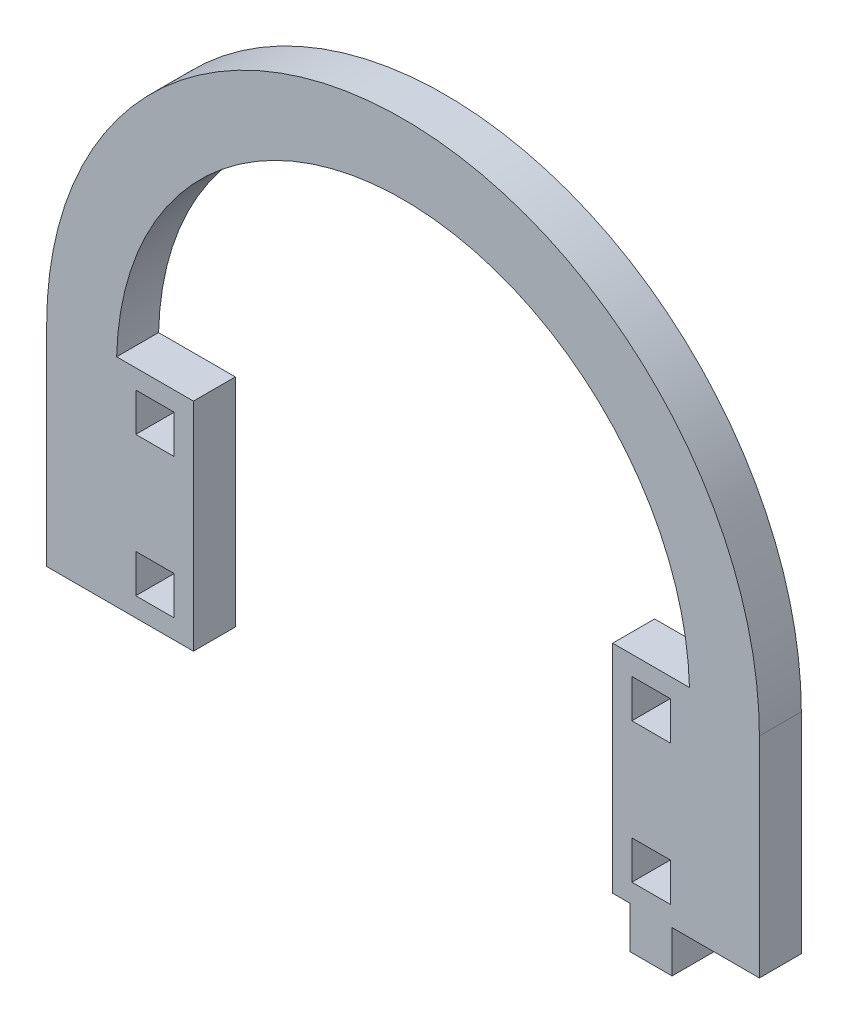
ISO-10303-21;
HEADER;
FILE_DESCRIPTION(('STEP AP214'),'2;1');
FILE_NAME('part.step','',(''),(''),'','','');
FILE_SCHEMA(('AUTOMOTIVE_DESIGN { 1 0 10303 214 1 1 1 1 }'));
ENDSEC;
DATA;
#1=APPLICATION_CONTEXT('core data for automotive mechanical design processes');
#2=APPLICATION_PROTOCOL_DEFINITION('international standard','automotive_design',2000,#1);
#3=PRODUCT_CONTEXT('',#1,'mechanical');
#4=PRODUCT('Part','Part','',(#3));
#5=PRODUCT_RELATED_PRODUCT_CATEGORY('part','',(#4));
#6=PRODUCT_DEFINITION_FORMATION('','',#4);
#7=PRODUCT_DEFINITION_CONTEXT('part definition',#1,'design');
#8=PRODUCT_DEFINITION('design','',#6,#7);
#9=PRODUCT_DEFINITION_SHAPE('','',#8);
#10=(LENGTH_UNIT() NAMED_UNIT(*) SI_UNIT(.MILLI.,.METRE.));
#11=(NAMED_UNIT(*) PLANE_ANGLE_UNIT() SI_UNIT($,.RADIAN.));
#12=(NAMED_UNIT(*) SI_UNIT($,.STERADIAN.) SOLID_ANGLE_UNIT());
#13=UNCERTAINTY_MEASURE_WITH_UNIT(LENGTH_MEASURE(1.E-05),#10,'distance_accuracy_value','');
#14=(GEOMETRIC_REPRESENTATION_CONTEXT(3) GLOBAL_UNCERTAINTY_ASSIGNED_CONTEXT((#13)) GLOBAL_UNIT_ASSIGNED_CONTEXT((#10,
#11,#12)) REPRESENTATION_CONTEXT('',''));
#15=CARTESIAN_POINT('',(0.,0.,0.));
#16=DIRECTION('',(0.,0.,1.));
#17=DIRECTION('',(1.,0.,0.));
#18=AXIS2_PLACEMENT_3D('',#15,#16,#17);
#19=CARTESIAN_POINT('',(3308.613450603,1322.3552410198,6.));
#20=DIRECTION('',(0.,0.,1.));
#21=DIRECTION('',(1.,0.,0.));
#22=AXIS2_PLACEMENT_3D('',#19,#20,#21);
#23=PLANE('',#22);
#24=CARTESIAN_POINT('',(3308.613450603,1322.3552410198,6.));
#25=DIRECTION('',(0.,0.,1.));
#26=DIRECTION('',(1.,0.,0.));
#27=AXIS2_PLACEMENT_3D('',#24,#25,#26);
#28=CIRCLE('',#27,50.9999999999999);
#29=CARTESIAN_POINT('',(3359.613450603,1322.3552410198,6.));
#30=VERTEX_POINT('',#29);
#31=CARTESIAN_POINT('',(3257.613450603,1322.3552410198,6.));
#32=VERTEX_POINT('',#31);
#33=EDGE_CURVE('E642',#30,#32,#28,.T.);
#34=ORIENTED_EDGE('',*,*,#33,.T.);
#35=DIRECTION('',(0.,-1.,0.));
#36=VECTOR('',#35,1.);
#37=CARTESIAN_POINT('',(3257.613450603,1322.3552410198,6.));
#38=LINE('',#37,#36);
#39=CARTESIAN_POINT('',(3257.613450603,1292.3552410198,6.));
#40=VERTEX_POINT('',#39);
#41=EDGE_CURVE('E646',#32,#40,#38,.T.);
#42=ORIENTED_EDGE('',*,*,#41,.T.);
#43=DIRECTION('',(1.,0.,0.));
#44=VECTOR('',#43,1.);
#45=CARTESIAN_POINT('',(3257.613450603,1292.3552410198,6.));
#46=LINE('',#45,#44);
#47=CARTESIAN_POINT('',(3278.613450603,1292.3552410198,6.));
#48=VERTEX_POINT('',#47);
#49=EDGE_CURVE('E650',#40,#48,#46,.T.);
#50=ORIENTED_EDGE('',*,*,#49,.T.);
#51=DIRECTION('',(0.,-1.,0.));
#52=VECTOR('',#51,1.);
#53=CARTESIAN_POINT('',(3278.613450603,1323.3552410198,6.));
#54=LINE('',#53,#52);
#55=CARTESIAN_POINT('',(3278.613450603,1323.3552410198,6.));
#56=VERTEX_POINT('',#55);
#57=EDGE_CURVE('E653',#56,#48,#54,.T.);
#58=ORIENTED_EDGE('',*,*,#57,.F.);
#59=DIRECTION('',(1.,0.,0.));
#60=VECTOR('',#59,1.);
#61=CARTESIAN_POINT('',(3267.62564753916,1323.3552410198,6.));
#62=LINE('',#61,#60);
#63=CARTESIAN_POINT('',(3267.62564753916,1323.3552410198,6.));
#64=VERTEX_POINT('',#63);
#65=EDGE_CURVE('E657',#64,#56,#62,.T.);
#66=ORIENTED_EDGE('',*,*,#65,.F.);
#67=CARTESIAN_POINT('',(3308.613450603,1322.3552410198,6.));
#68=DIRECTION('',(0.,0.,1.));
#69=DIRECTION('',(1.,0.,0.));
#70=AXIS2_PLACEMENT_3D('',#67,#68,#69);
#71=CIRCLE('',#70,40.9999999999998);
#72=CARTESIAN_POINT('',(3349.60125366684,1323.3552410198,6.));
#73=VERTEX_POINT('',#72);
#74=EDGE_CURVE('E661',#73,#64,#71,.T.);
#75=ORIENTED_EDGE('',*,*,#74,.F.);
#76=DIRECTION('',(1.,0.,0.));
#77=VECTOR('',#76,1.);
#78=CARTESIAN_POINT('',(3338.613450603,1323.3552410198,6.));
#79=LINE('',#78,#77);
#80=CARTESIAN_POINT('',(3338.613450603,1323.3552410198,6.));
#81=VERTEX_POINT('',#80);
#82=EDGE_CURVE('E665',#81,#73,#79,.T.);
#83=ORIENTED_EDGE('',*,*,#82,.F.);
#84=DIRECTION('',(0.,-1.,0.));
#85=VECTOR('',#84,1.);
#86=CARTESIAN_POINT('',(3338.613450603,1323.3552410198,6.));
#87=LINE('',#86,#85);
#88=CARTESIAN_POINT('',(3338.613450603,1292.3552410198,6.));
#89=VERTEX_POINT('',#88);
#90=EDGE_CURVE('E669',#81,#89,#87,.T.);
#91=ORIENTED_EDGE('',*,*,#90,.T.);
#92=DIRECTION('',(1.,0.,0.));
#93=VECTOR('',#92,1.);
#94=CARTESIAN_POINT('',(3338.613450603,1292.3552410198,6.));
#95=LINE('',#94,#93);
#96=CARTESIAN_POINT('',(3341.113450603,1292.3552410198,6.));
#97=VERTEX_POINT('',#96);
#98=EDGE_CURVE('E672',#89,#97,#95,.T.);
#99=ORIENTED_EDGE('',*,*,#98,.T.);
#100=DIRECTION('',(0.,-1.,0.));
#101=VECTOR('',#100,1.);
#102=CARTESIAN_POINT('',(3341.113450603,1292.3552410198,6.));
#103=LINE('',#102,#101);
#104=CARTESIAN_POINT('',(3341.113450603,1286.3552410198,6.));
#105=VERTEX_POINT('',#104);
#106=EDGE_CURVE('E675',#97,#105,#103,.T.);
#107=ORIENTED_EDGE('',*,*,#106,.T.);
#108=DIRECTION('',(1.,0.,0.));
#109=VECTOR('',#108,1.);
#110=CARTESIAN_POINT('',(3341.113450603,1286.3552410198,6.));
#111=LINE('',#110,#109);
#112=CARTESIAN_POINT('',(3347.113450603,1286.3552410198,6.));
#113=VERTEX_POINT('',#112);
#114=EDGE_CURVE('E678',#105,#113,#111,.T.);
#115=ORIENTED_EDGE('',*,*,#114,.T.);
#116=DIRECTION('',(0.,1.,0.));
#117=VECTOR('',#116,1.);
#118=CARTESIAN_POINT('',(3347.113450603,1286.3552410198,6.));
#119=LINE('',#118,#117);
#120=CARTESIAN_POINT('',(3347.113450603,1292.3552410198,6.));
#121=VERTEX_POINT('',#120);
#122=EDGE_CURVE('E681',#113,#121,#119,.T.);
#123=ORIENTED_EDGE('',*,*,#122,.T.);
#124=DIRECTION('',(1.,0.,0.));
#125=VECTOR('',#124,1.);
#126=CARTESIAN_POINT('',(3347.113450603,1292.3552410198,6.));
#127=LINE('',#126,#125);
#128=CARTESIAN_POINT('',(3359.613450603,1292.3552410198,6.));
#129=VERTEX_POINT('',#128);
#130=EDGE_CURVE('E684',#121,#129,#127,.T.);
#131=ORIENTED_EDGE('',*,*,#130,.T.);
#132=DIRECTION('',(0.,-1.,0.));
#133=VECTOR('',#132,1.);
#134=CARTESIAN_POINT('',(3359.613450603,1322.3552410198,6.));
#135=LINE('',#134,#133);
#136=EDGE_CURVE('E687',#30,#129,#135,.T.);
#137=ORIENTED_EDGE('',*,*,#136,.F.);
#138=EDGE_LOOP('',(#34,#42,#50,#58,#66,#75,#83,#91,#99,#107,#115,#123,#131,#137));
#139=FACE_BOUND('',#138,.T.);
#140=DIRECTION('',(0.,1.,0.));
#141=VECTOR('',#140,1.);
#142=CARTESIAN_POINT('',(3275.863450603,0.,6.));
#143=LINE('',#142,#141);
#144=CARTESIAN_POINT('',(3275.863450603,1315.1052410198,6.));
#145=VERTEX_POINT('',#144);
#146=CARTESIAN_POINT('',(3275.863450603,1320.6052410198,6.));
#147=VERTEX_POINT('',#146);
#148=EDGE_CURVE('E602',#145,#147,#143,.T.);
#149=ORIENTED_EDGE('',*,*,#148,.F.);
#150=DIRECTION('',(1.,0.,0.));
#151=VECTOR('',#150,1.);
#152=CARTESIAN_POINT('',(0.,1315.1052410198,6.));
#153=LINE('',#152,#151);
#154=CARTESIAN_POINT('',(3270.363450603,1315.1052410198,6.));
#155=VERTEX_POINT('',#154);
#156=EDGE_CURVE('E599',#155,#145,#153,.T.);
#157=ORIENTED_EDGE('',*,*,#156,.F.);
#158=DIRECTION('',(0.,-1.,0.));
#159=VECTOR('',#158,1.);
#160=CARTESIAN_POINT('',(3270.363450603,0.,6.));
#161=LINE('',#160,#159);
#162=CARTESIAN_POINT('',(3270.363450603,1320.6052410198,6.));
#163=VERTEX_POINT('',#162);
#164=EDGE_CURVE('E610',#163,#155,#161,.T.);
#165=ORIENTED_EDGE('',*,*,#164,.F.);
#166=DIRECTION('',(-1.,0.,0.));
#167=VECTOR('',#166,1.);
#168=CARTESIAN_POINT('',(0.,1320.6052410198,6.));
#169=LINE('',#168,#167);
#170=EDGE_CURVE('E606',#147,#163,#169,.T.);
#171=ORIENTED_EDGE('',*,*,#170,.F.);
#172=EDGE_LOOP('',(#149,#157,#165,#171));
#173=FACE_BOUND('',#172,.T.);
#174=DIRECTION('',(0.,1.,0.));
#175=VECTOR('',#174,1.);
#176=CARTESIAN_POINT('',(3275.863450603,0.,6.));
#177=LINE('',#176,#175);
#178=CARTESIAN_POINT('',(3275.863450603,1295.1052410198,6.));
#179=VERTEX_POINT('',#178);
#180=CARTESIAN_POINT('',(3275.863450603,1300.6052410198,6.));
#181=VERTEX_POINT('',#180);
#182=EDGE_CURVE('E559',#179,#181,#177,.T.);
#183=ORIENTED_EDGE('',*,*,#182,.F.);
#184=DIRECTION('',(1.,0.,0.));
#185=VECTOR('',#184,1.);
#186=CARTESIAN_POINT('',(0.,1295.1052410198,6.));
#187=LINE('',#186,#185);
#188=CARTESIAN_POINT('',(3270.363450603,1295.1052410198,6.));
#189=VERTEX_POINT('',#188);
#190=EDGE_CURVE('E556',#189,#179,#187,.T.);
#191=ORIENTED_EDGE('',*,*,#190,.F.);
#192=DIRECTION('',(0.,-1.,0.));
#193=VECTOR('',#192,1.);
#194=CARTESIAN_POINT('',(3270.363450603,0.,6.));
#195=LINE('',#194,#193);
#196=CARTESIAN_POINT('',(3270.363450603,1300.6052410198,6.));
#197=VERTEX_POINT('',#196);
#198=EDGE_CURVE('E567',#197,#189,#195,.T.);
#199=ORIENTED_EDGE('',*,*,#198,.F.);
#200=DIRECTION('',(-1.,0.,0.));
#201=VECTOR('',#200,1.);
#202=CARTESIAN_POINT('',(0.,1300.6052410198,6.));
#203=LINE('',#202,#201);
#204=EDGE_CURVE('E563',#181,#197,#203,.T.);
#205=ORIENTED_EDGE('',*,*,#204,.F.);
#206=EDGE_LOOP('',(#183,#191,#199,#205));
#207=FACE_BOUND('',#206,.T.);
#208=DIRECTION('',(0.,1.,0.));
#209=VECTOR('',#208,1.);
#210=CARTESIAN_POINT('',(3346.863450603,0.,6.));
#211=LINE('',#210,#209);
#212=CARTESIAN_POINT('',(3346.863450603,1315.1052410198,6.));
#213=VERTEX_POINT('',#212);
#214=CARTESIAN_POINT('',(3346.863450603,1320.6052410198,6.));
#215=VERTEX_POINT('',#214);
#216=EDGE_CURVE('E516',#213,#215,#211,.T.);
#217=ORIENTED_EDGE('',*,*,#216,.F.);
#218=DIRECTION('',(1.,0.,0.));
#219=VECTOR('',#218,1.);
#220=CARTESIAN_POINT('',(0.,1315.1052410198,6.));
#221=LINE('',#220,#219);
#222=CARTESIAN_POINT('',(3341.363450603,1315.1052410198,6.));
#223=VERTEX_POINT('',#222);
#224=EDGE_CURVE('E513',#223,#213,#221,.T.);
#225=ORIENTED_EDGE('',*,*,#224,.F.);
#226=DIRECTION('',(0.,-1.,0.));
#227=VECTOR('',#226,1.);
#228=CARTESIAN_POINT('',(3341.363450603,0.,6.));
#229=LINE('',#228,#227);
#230=CARTESIAN_POINT('',(3341.363450603,1320.6052410198,6.));
#231=VERTEX_POINT('',#230);
#232=EDGE_CURVE('E524',#231,#223,#229,.T.);
#233=ORIENTED_EDGE('',*,*,#232,.F.);
#234=DIRECTION('',(-1.,0.,0.));
#235=VECTOR('',#234,1.);
#236=CARTESIAN_POINT('',(0.,1320.6052410198,6.));
#237=LINE('',#236,#235);
#238=EDGE_CURVE('E520',#215,#231,#237,.T.);
#239=ORIENTED_EDGE('',*,*,#238,.F.);
#240=EDGE_LOOP('',(#217,#225,#233,#239));
#241=FACE_BOUND('',#240,.T.);
#242=DIRECTION('',(0.,1.,0.));
#243=VECTOR('',#242,1.);
#244=CARTESIAN_POINT('',(3346.863450603,0.,6.));
#245=LINE('',#244,#243);
#246=CARTESIAN_POINT('',(3346.863450603,1295.1052410198,6.));
#247=VERTEX_POINT('',#246);
#248=CARTESIAN_POINT('',(3346.863450603,1300.6052410198,6.));
#249=VERTEX_POINT('',#248);
#250=EDGE_CURVE('E474',#247,#249,#245,.T.);
#251=ORIENTED_EDGE('',*,*,#250,.F.);
#252=DIRECTION('',(1.,0.,0.));
#253=VECTOR('',#252,1.);
#254=CARTESIAN_POINT('',(0.,1295.1052410198,6.));
#255=LINE('',#254,#253);
#256=CARTESIAN_POINT('',(3341.363450603,1295.1052410198,6.));
#257=VERTEX_POINT('',#256);
#258=EDGE_CURVE('E465',#257,#247,#255,.T.);
#259=ORIENTED_EDGE('',*,*,#258,.F.);
#260=DIRECTION('',(0.,-1.,0.));
#261=VECTOR('',#260,1.);
#262=CARTESIAN_POINT('',(3341.363450603,0.,6.));
#263=LINE('',#262,#261);
#264=CARTESIAN_POINT('',(3341.363450603,1300.6052410198,6.));
#265=VERTEX_POINT('',#264);
#266=EDGE_CURVE('E491',#265,#257,#263,.T.);
#267=ORIENTED_EDGE('',*,*,#266,.F.);
#268=DIRECTION('',(-1.,0.,0.));
#269=VECTOR('',#268,1.);
#270=CARTESIAN_POINT('',(0.,1300.6052410198,6.));
#271=LINE('',#270,#269);
#272=EDGE_CURVE('E487',#249,#265,#271,.T.);
#273=ORIENTED_EDGE('',*,*,#272,.F.);
#274=EDGE_LOOP('',(#251,#259,#267,#273));
#275=FACE_BOUND('',#274,.T.);
#276=ADVANCED_FACE('F267',(#139,#173,#207,#241,#275),#23,.T.);
#277=CARTESIAN_POINT('',(3308.613450603,1322.3552410198,0.));
#278=DIRECTION('',(0.,0.,1.));
#279=DIRECTION('',(1.,0.,0.));
#280=AXIS2_PLACEMENT_3D('',#277,#278,#279);
#281=PLANE('',#280);
#282=DIRECTION('',(1.,0.,0.));
#283=VECTOR('',#282,1.);
#284=CARTESIAN_POINT('',(0.,1315.1052410198,0.));
#285=LINE('',#284,#283);
#286=CARTESIAN_POINT('',(3341.363450603,1315.1052410198,0.));
#287=VERTEX_POINT('',#286);
#288=CARTESIAN_POINT('',(3346.863450603,1315.1052410198,0.));
#289=VERTEX_POINT('',#288);
#290=EDGE_CURVE('E483',#287,#289,#285,.T.);
#291=ORIENTED_EDGE('',*,*,#290,.T.);
#292=DIRECTION('',(0.,1.,0.));
#293=VECTOR('',#292,1.);
#294=CARTESIAN_POINT('',(3346.863450603,0.,0.));
#295=LINE('',#294,#293);
#296=CARTESIAN_POINT('',(3346.863450603,1320.6052410198,0.));
#297=VERTEX_POINT('',#296);
#298=EDGE_CURVE('E531',#289,#297,#295,.T.);
#299=ORIENTED_EDGE('',*,*,#298,.T.);
#300=DIRECTION('',(-1.,0.,0.));
#301=VECTOR('',#300,1.);
#302=CARTESIAN_POINT('',(0.,1320.6052410198,0.));
#303=LINE('',#302,#301);
#304=CARTESIAN_POINT('',(3341.363450603,1320.6052410198,0.));
#305=VERTEX_POINT('',#304);
#306=EDGE_CURVE('E535',#297,#305,#303,.T.);
#307=ORIENTED_EDGE('',*,*,#306,.T.);
#308=DIRECTION('',(0.,-1.,0.));
#309=VECTOR('',#308,1.);
#310=CARTESIAN_POINT('',(3341.363450603,0.,0.));
#311=LINE('',#310,#309);
#312=EDGE_CURVE('E517',#305,#287,#311,.T.);
#313=ORIENTED_EDGE('',*,*,#312,.T.);
#314=EDGE_LOOP('',(#291,#299,#307,#313));
#315=FACE_BOUND('',#314,.T.);
#316=DIRECTION('',(1.,0.,0.));
#317=VECTOR('',#316,1.);
#318=CARTESIAN_POINT('',(0.,1315.1052410198,0.));
#319=LINE('',#318,#317);
#320=CARTESIAN_POINT('',(3270.363450603,1315.1052410198,0.));
#321=VERTEX_POINT('',#320);
#322=CARTESIAN_POINT('',(3275.863450603,1315.1052410198,0.));
#323=VERTEX_POINT('',#322);
#324=EDGE_CURVE('E598',#321,#323,#319,.T.);
#325=ORIENTED_EDGE('',*,*,#324,.T.);
#326=DIRECTION('',(0.,1.,0.));
#327=VECTOR('',#326,1.);
#328=CARTESIAN_POINT('',(3275.863450603,0.,0.));
#329=LINE('',#328,#327);
#330=CARTESIAN_POINT('',(3275.863450603,1320.6052410198,0.));
#331=VERTEX_POINT('',#330);
#332=EDGE_CURVE('E617',#323,#331,#329,.T.);
#333=ORIENTED_EDGE('',*,*,#332,.T.);
#334=DIRECTION('',(-1.,0.,0.));
#335=VECTOR('',#334,1.);
#336=CARTESIAN_POINT('',(0.,1320.6052410198,0.));
#337=LINE('',#336,#335);
#338=CARTESIAN_POINT('',(3270.363450603,1320.6052410198,0.));
#339=VERTEX_POINT('',#338);
#340=EDGE_CURVE('E621',#331,#339,#337,.T.);
#341=ORIENTED_EDGE('',*,*,#340,.T.);
#342=DIRECTION('',(0.,-1.,0.));
#343=VECTOR('',#342,1.);
#344=CARTESIAN_POINT('',(3270.363450603,0.,0.));
#345=LINE('',#344,#343);
#346=EDGE_CURVE('E603',#339,#321,#345,.T.);
#347=ORIENTED_EDGE('',*,*,#346,.T.);
#348=EDGE_LOOP('',(#325,#333,#341,#347));
#349=FACE_BOUND('',#348,.T.);
#350=CARTESIAN_POINT('',(3308.613450603,1322.3552410198,0.));
#351=DIRECTION('',(0.,0.,1.));
#352=DIRECTION('',(1.,0.,0.));
#353=AXIS2_PLACEMENT_3D('',#350,#351,#352);
#354=CIRCLE('',#353,50.9999999999999);
#355=CARTESIAN_POINT('',(3359.613450603,1322.3552410198,0.));
#356=VERTEX_POINT('',#355);
#357=CARTESIAN_POINT('',(3257.613450603,1322.3552410198,0.));
#358=VERTEX_POINT('',#357);
#359=EDGE_CURVE('E641',#356,#358,#354,.T.);
#360=ORIENTED_EDGE('',*,*,#359,.F.);
#361=DIRECTION('',(0.,-1.,0.));
#362=VECTOR('',#361,1.);
#363=CARTESIAN_POINT('',(3359.613450603,1322.3552410198,0.));
#364=LINE('',#363,#362);
#365=CARTESIAN_POINT('',(3359.613450603,1292.3552410198,0.));
#366=VERTEX_POINT('',#365);
#367=EDGE_CURVE('E647',#356,#366,#364,.T.);
#368=ORIENTED_EDGE('',*,*,#367,.T.);
#369=DIRECTION('',(1.,0.,0.));
#370=VECTOR('',#369,1.);
#371=CARTESIAN_POINT('',(3347.113450603,1292.3552410198,0.));
#372=LINE('',#371,#370);
#373=CARTESIAN_POINT('',(3347.113450603,1292.3552410198,0.));
#374=VERTEX_POINT('',#373);
#375=EDGE_CURVE('E734',#374,#366,#372,.T.);
#376=ORIENTED_EDGE('',*,*,#375,.F.);
#377=DIRECTION('',(0.,1.,0.));
#378=VECTOR('',#377,1.);
#379=CARTESIAN_POINT('',(3347.113450603,1286.3552410198,0.));
#380=LINE('',#379,#378);
#381=CARTESIAN_POINT('',(3347.113450603,1286.3552410198,0.));
#382=VERTEX_POINT('',#381);
#383=EDGE_CURVE('E731',#382,#374,#380,.T.);
#384=ORIENTED_EDGE('',*,*,#383,.F.);
#385=DIRECTION('',(1.,0.,0.));
#386=VECTOR('',#385,1.);
#387=CARTESIAN_POINT('',(3341.113450603,1286.3552410198,0.));
#388=LINE('',#387,#386);
#389=CARTESIAN_POINT('',(3341.113450603,1286.3552410198,0.));
#390=VERTEX_POINT('',#389);
#391=EDGE_CURVE('E728',#390,#382,#388,.T.);
#392=ORIENTED_EDGE('',*,*,#391,.F.);
#393=DIRECTION('',(0.,-1.,0.));
#394=VECTOR('',#393,1.);
#395=CARTESIAN_POINT('',(3341.113450603,1292.3552410198,0.));
#396=LINE('',#395,#394);
#397=CARTESIAN_POINT('',(3341.113450603,1292.3552410198,0.));
#398=VERTEX_POINT('',#397);
#399=EDGE_CURVE('E725',#398,#390,#396,.T.);
#400=ORIENTED_EDGE('',*,*,#399,.F.);
#401=DIRECTION('',(1.,0.,0.));
#402=VECTOR('',#401,1.);
#403=CARTESIAN_POINT('',(3338.613450603,1292.3552410198,0.));
#404=LINE('',#403,#402);
#405=CARTESIAN_POINT('',(3338.613450603,1292.3552410198,0.));
#406=VERTEX_POINT('',#405);
#407=EDGE_CURVE('E722',#406,#398,#404,.T.);
#408=ORIENTED_EDGE('',*,*,#407,.F.);
#409=DIRECTION('',(0.,-1.,0.));
#410=VECTOR('',#409,1.);
#411=CARTESIAN_POINT('',(3338.613450603,1323.3552410198,0.));
#412=LINE('',#411,#410);
#413=CARTESIAN_POINT('',(3338.613450603,1323.3552410198,0.));
#414=VERTEX_POINT('',#413);
#415=EDGE_CURVE('E719',#414,#406,#412,.T.);
#416=ORIENTED_EDGE('',*,*,#415,.F.);
#417=DIRECTION('',(1.,0.,0.));
#418=VECTOR('',#417,1.);
#419=CARTESIAN_POINT('',(3338.613450603,1323.3552410198,0.));
#420=LINE('',#419,#418);
#421=CARTESIAN_POINT('',(3349.60125366684,1323.3552410198,0.));
#422=VERTEX_POINT('',#421);
#423=EDGE_CURVE('E715',#414,#422,#420,.T.);
#424=ORIENTED_EDGE('',*,*,#423,.T.);
#425=CARTESIAN_POINT('',(3308.613450603,1322.3552410198,0.));
#426=DIRECTION('',(0.,0.,1.));
#427=DIRECTION('',(1.,0.,0.));
#428=AXIS2_PLACEMENT_3D('',#425,#426,#427);
#429=CIRCLE('',#428,40.9999999999998);
#430=CARTESIAN_POINT('',(3267.62564753916,1323.3552410198,0.));
#431=VERTEX_POINT('',#430);
#432=EDGE_CURVE('E711',#422,#431,#429,.T.);
#433=ORIENTED_EDGE('',*,*,#432,.T.);
#434=DIRECTION('',(1.,0.,0.));
#435=VECTOR('',#434,1.);
#436=CARTESIAN_POINT('',(3267.62564753916,1323.3552410198,0.));
#437=LINE('',#436,#435);
#438=CARTESIAN_POINT('',(3278.613450603,1323.3552410198,0.));
#439=VERTEX_POINT('',#438);
#440=EDGE_CURVE('E707',#431,#439,#437,.T.);
#441=ORIENTED_EDGE('',*,*,#440,.T.);
#442=DIRECTION('',(0.,-1.,0.));
#443=VECTOR('',#442,1.);
#444=CARTESIAN_POINT('',(3278.613450603,1323.3552410198,0.));
#445=LINE('',#444,#443);
#446=CARTESIAN_POINT('',(3278.613450603,1292.3552410198,0.));
#447=VERTEX_POINT('',#446);
#448=EDGE_CURVE('E703',#439,#447,#445,.T.);
#449=ORIENTED_EDGE('',*,*,#448,.T.);
#450=DIRECTION('',(1.,0.,0.));
#451=VECTOR('',#450,1.);
#452=CARTESIAN_POINT('',(3267.613450603,1292.3552410198,0.));
#453=LINE('',#452,#451);
#454=CARTESIAN_POINT('',(3257.613450603,1292.3552410198,0.));
#455=VERTEX_POINT('',#454);
#456=EDGE_CURVE('E699',#455,#447,#453,.T.);
#457=ORIENTED_EDGE('',*,*,#456,.F.);
#458=DIRECTION('',(0.,-1.,0.));
#459=VECTOR('',#458,1.);
#460=CARTESIAN_POINT('',(3257.613450603,1322.3552410198,0.));
#461=LINE('',#460,#459);
#462=EDGE_CURVE('E695',#358,#455,#461,.T.);
#463=ORIENTED_EDGE('',*,*,#462,.F.);
#464=EDGE_LOOP('',(#360,#368,#376,#384,#392,#400,#408,#416,#424,#433,#441,#449,#457,#463));
#465=FACE_BOUND('',#464,.T.);
#466=DIRECTION('',(1.,0.,0.));
#467=VECTOR('',#466,1.);
#468=CARTESIAN_POINT('',(0.,1295.1052410198,0.));
#469=LINE('',#468,#467);
#470=CARTESIAN_POINT('',(3270.363450603,1295.1052410198,0.));
#471=VERTEX_POINT('',#470);
#472=CARTESIAN_POINT('',(3275.863450603,1295.1052410198,0.));
#473=VERTEX_POINT('',#472);
#474=EDGE_CURVE('E555',#471,#473,#469,.T.);
#475=ORIENTED_EDGE('',*,*,#474,.T.);
#476=DIRECTION('',(0.,1.,0.));
#477=VECTOR('',#476,1.);
#478=CARTESIAN_POINT('',(3275.863450603,0.,0.));
#479=LINE('',#478,#477);
#480=CARTESIAN_POINT('',(3275.863450603,1300.6052410198,0.));
#481=VERTEX_POINT('',#480);
#482=EDGE_CURVE('E574',#473,#481,#479,.T.);
#483=ORIENTED_EDGE('',*,*,#482,.T.);
#484=DIRECTION('',(-1.,0.,0.));
#485=VECTOR('',#484,1.);
#486=CARTESIAN_POINT('',(0.,1300.6052410198,0.));
#487=LINE('',#486,#485);
#488=CARTESIAN_POINT('',(3270.363450603,1300.6052410198,0.));
#489=VERTEX_POINT('',#488);
#490=EDGE_CURVE('E578',#481,#489,#487,.T.);
#491=ORIENTED_EDGE('',*,*,#490,.T.);
#492=DIRECTION('',(0.,-1.,0.));
#493=VECTOR('',#492,1.);
#494=CARTESIAN_POINT('',(3270.363450603,0.,0.));
#495=LINE('',#494,#493);
#496=EDGE_CURVE('E560',#489,#471,#495,.T.);
#497=ORIENTED_EDGE('',*,*,#496,.T.);
#498=EDGE_LOOP('',(#475,#483,#491,#497));
#499=FACE_BOUND('',#498,.T.);
#500=DIRECTION('',(1.,0.,0.));
#501=VECTOR('',#500,1.);
#502=CARTESIAN_POINT('',(0.,1295.1052410198,0.));
#503=LINE('',#502,#501);
#504=CARTESIAN_POINT('',(3341.363450603,1295.1052410198,0.));
#505=VERTEX_POINT('',#504);
#506=CARTESIAN_POINT('',(3346.863450603,1295.1052410198,0.));
#507=VERTEX_POINT('',#506);
#508=EDGE_CURVE('E291',#505,#507,#503,.T.);
#509=ORIENTED_EDGE('',*,*,#508,.T.);
#510=DIRECTION('',(0.,1.,0.));
#511=VECTOR('',#510,1.);
#512=CARTESIAN_POINT('',(3346.863450603,0.,0.));
#513=LINE('',#512,#511);
#514=CARTESIAN_POINT('',(3346.863450603,1300.6052410198,0.));
#515=VERTEX_POINT('',#514);
#516=EDGE_CURVE('E481',#507,#515,#513,.T.);
#517=ORIENTED_EDGE('',*,*,#516,.T.);
#518=DIRECTION('',(-1.,0.,0.));
#519=VECTOR('',#518,1.);
#520=CARTESIAN_POINT('',(0.,1300.6052410198,0.));
#521=LINE('',#520,#519);
#522=CARTESIAN_POINT('',(3341.363450603,1300.6052410198,0.));
#523=VERTEX_POINT('',#522);
#524=EDGE_CURVE('E500',#515,#523,#521,.T.);
#525=ORIENTED_EDGE('',*,*,#524,.T.);
#526=DIRECTION('',(0.,-1.,0.));
#527=VECTOR('',#526,1.);
#528=CARTESIAN_POINT('',(3341.363450603,0.,0.));
#529=LINE('',#528,#527);
#530=EDGE_CURVE('E475',#523,#505,#529,.T.);
#531=ORIENTED_EDGE('',*,*,#530,.T.);
#532=EDGE_LOOP('',(#509,#517,#525,#531));
#533=FACE_BOUND('',#532,.T.);
#534=ADVANCED_FACE('F792',(#315,#349,#465,#499,#533),#281,.F.);
#535=CARTESIAN_POINT('',(3308.613450603,1322.3552410198,6.));
#536=DIRECTION('',(0.,0.,-1.));
#537=DIRECTION('',(-1.,0.,0.));
#538=AXIS2_PLACEMENT_3D('',#535,#536,#537);
#539=CYLINDRICAL_SURFACE('',#538,50.9999999999999);
#540=ORIENTED_EDGE('',*,*,#359,.T.);
#541=DIRECTION('',(0.,0.,-1.));
#542=VECTOR('',#541,1.);
#543=CARTESIAN_POINT('',(3257.613450603,1322.3552410198,6.));
#544=LINE('',#543,#542);
#545=EDGE_CURVE('E12',#32,#358,#544,.T.);
#546=ORIENTED_EDGE('',*,*,#545,.F.);
#547=ORIENTED_EDGE('',*,*,#33,.F.);
#548=DIRECTION('',(0.,0.,-1.));
#549=VECTOR('',#548,1.);
#550=CARTESIAN_POINT('',(3359.613450603,1322.3552410198,6.));
#551=LINE('',#550,#549);
#552=EDGE_CURVE('E691',#30,#356,#551,.T.);
#553=ORIENTED_EDGE('',*,*,#552,.T.);
#554=EDGE_LOOP('',(#540,#546,#547,#553));
#555=FACE_BOUND('',#554,.T.);
#556=ADVANCED_FACE('F269',(#555),#539,.T.);
#557=CARTESIAN_POINT('',(3257.613450603,1322.3552410198,6.));
#558=DIRECTION('',(1.,0.,0.));
#559=DIRECTION('',(0.,0.,-1.));
#560=AXIS2_PLACEMENT_3D('',#557,#558,#559);
#561=PLANE('',#560);
#562=ORIENTED_EDGE('',*,*,#462,.T.);
#563=DIRECTION('',(0.,0.,-1.));
#564=VECTOR('',#563,1.);
#565=CARTESIAN_POINT('',(3257.613450603,1292.3552410198,6.));
#566=LINE('',#565,#564);
#567=EDGE_CURVE('E276',#40,#455,#566,.T.);
#568=ORIENTED_EDGE('',*,*,#567,.F.);
#569=ORIENTED_EDGE('',*,*,#41,.F.);
#570=ORIENTED_EDGE('',*,*,#545,.T.);
#571=EDGE_LOOP('',(#562,#568,#569,#570));
#572=FACE_BOUND('',#571,.T.);
#573=ADVANCED_FACE('F788',(#572),#561,.F.);
#574=CARTESIAN_POINT('',(3267.613450603,1292.3552410198,6.));
#575=DIRECTION('',(0.,1.,0.));
#576=DIRECTION('',(0.,0.,1.));
#577=AXIS2_PLACEMENT_3D('',#574,#575,#576);
#578=PLANE('',#577);
#579=ORIENTED_EDGE('',*,*,#456,.T.);
#580=DIRECTION('',(0.,0.,-1.));
#581=VECTOR('',#580,1.);
#582=CARTESIAN_POINT('',(3278.613450603,1292.3552410198,6.));
#583=LINE('',#582,#581);
#584=EDGE_CURVE('E778',#48,#447,#583,.T.);
#585=ORIENTED_EDGE('',*,*,#584,.F.);
#586=ORIENTED_EDGE('',*,*,#49,.F.);
#587=ORIENTED_EDGE('',*,*,#567,.T.);
#588=EDGE_LOOP('',(#579,#585,#586,#587));
#589=FACE_BOUND('',#588,.T.);
#590=ADVANCED_FACE('F785',(#589),#578,.F.);
#591=CARTESIAN_POINT('',(3278.613450603,1323.3552410198,6.));
#592=DIRECTION('',(1.,0.,0.));
#593=DIRECTION('',(0.,0.,-1.));
#594=AXIS2_PLACEMENT_3D('',#591,#592,#593);
#595=PLANE('',#594);
#596=ORIENTED_EDGE('',*,*,#448,.F.);
#597=DIRECTION('',(0.,0.,-1.));
#598=VECTOR('',#597,1.);
#599=CARTESIAN_POINT('',(3278.613450603,1323.3552410198,6.));
#600=LINE('',#599,#598);
#601=EDGE_CURVE('E775',#56,#439,#600,.T.);
#602=ORIENTED_EDGE('',*,*,#601,.F.);
#603=ORIENTED_EDGE('',*,*,#57,.T.);
#604=ORIENTED_EDGE('',*,*,#584,.T.);
#605=EDGE_LOOP('',(#596,#602,#603,#604));
#606=FACE_BOUND('',#605,.T.);
#607=ADVANCED_FACE('F798',(#606),#595,.T.);
#608=CARTESIAN_POINT('',(3267.62564753916,1323.3552410198,6.));
#609=DIRECTION('',(0.,1.,0.));
#610=DIRECTION('',(-1.,0.,0.));
#611=AXIS2_PLACEMENT_3D('',#608,#609,#610);
#612=PLANE('',#611);
#613=ORIENTED_EDGE('',*,*,#440,.F.);
#614=DIRECTION('',(0.,0.,-1.));
#615=VECTOR('',#614,1.);
#616=CARTESIAN_POINT('',(3267.62564753916,1323.3552410198,6.));
#617=LINE('',#616,#615);
#618=EDGE_CURVE('E772',#64,#431,#617,.T.);
#619=ORIENTED_EDGE('',*,*,#618,.F.);
#620=ORIENTED_EDGE('',*,*,#65,.T.);
#621=ORIENTED_EDGE('',*,*,#601,.T.);
#622=EDGE_LOOP('',(#613,#619,#620,#621));
#623=FACE_BOUND('',#622,.T.);
#624=ADVANCED_FACE('F805',(#623),#612,.T.);
#625=CARTESIAN_POINT('',(3308.613450603,1322.3552410198,6.));
#626=DIRECTION('',(0.,0.,-1.));
#627=DIRECTION('',(-1.,0.,0.));
#628=AXIS2_PLACEMENT_3D('',#625,#626,#627);
#629=CYLINDRICAL_SURFACE('',#628,40.9999999999998);
#630=ORIENTED_EDGE('',*,*,#432,.F.);
#631=DIRECTION('',(0.,0.,-1.));
#632=VECTOR('',#631,1.);
#633=CARTESIAN_POINT('',(3349.60125366684,1323.3552410198,6.));
#634=LINE('',#633,#632);
#635=EDGE_CURVE('E769',#73,#422,#634,.T.);
#636=ORIENTED_EDGE('',*,*,#635,.F.);
#637=ORIENTED_EDGE('',*,*,#74,.T.);
#638=ORIENTED_EDGE('',*,*,#618,.T.);
#639=EDGE_LOOP('',(#630,#636,#637,#638));
#640=FACE_BOUND('',#639,.T.);
#641=ADVANCED_FACE('F808',(#640),#629,.F.);
#642=CARTESIAN_POINT('',(3338.613450603,1323.3552410198,6.));
#643=DIRECTION('',(0.,1.,0.));
#644=DIRECTION('',(-1.,0.,0.));
#645=AXIS2_PLACEMENT_3D('',#642,#643,#644);
#646=PLANE('',#645);
#647=ORIENTED_EDGE('',*,*,#423,.F.);
#648=DIRECTION('',(0.,0.,-1.));
#649=VECTOR('',#648,1.);
#650=CARTESIAN_POINT('',(3338.613450603,1323.3552410198,6.));
#651=LINE('',#650,#649);
#652=EDGE_CURVE('E766',#81,#414,#651,.T.);
#653=ORIENTED_EDGE('',*,*,#652,.F.);
#654=ORIENTED_EDGE('',*,*,#82,.T.);
#655=ORIENTED_EDGE('',*,*,#635,.T.);
#656=EDGE_LOOP('',(#647,#653,#654,#655));
#657=FACE_BOUND('',#656,.T.);
#658=ADVANCED_FACE('F812',(#657),#646,.T.);
#659=CARTESIAN_POINT('',(3338.613450603,1323.3552410198,6.));
#660=DIRECTION('',(1.,0.,0.));
#661=DIRECTION('',(0.,0.,-1.));
#662=AXIS2_PLACEMENT_3D('',#659,#660,#661);
#663=PLANE('',#662);
#664=ORIENTED_EDGE('',*,*,#415,.T.);
#665=DIRECTION('',(0.,0.,-1.));
#666=VECTOR('',#665,1.);
#667=CARTESIAN_POINT('',(3338.613450603,1292.3552410198,6.));
#668=LINE('',#667,#666);
#669=EDGE_CURVE('E762',#89,#406,#668,.T.);
#670=ORIENTED_EDGE('',*,*,#669,.F.);
#671=ORIENTED_EDGE('',*,*,#90,.F.);
#672=ORIENTED_EDGE('',*,*,#652,.T.);
#673=EDGE_LOOP('',(#664,#670,#671,#672));
#674=FACE_BOUND('',#673,.T.);
#675=ADVANCED_FACE('F817',(#674),#663,.F.);
#676=CARTESIAN_POINT('',(3338.613450603,1292.3552410198,6.));
#677=DIRECTION('',(0.,1.,0.));
#678=DIRECTION('',(0.,0.,1.));
#679=AXIS2_PLACEMENT_3D('',#676,#677,#678);
#680=PLANE('',#679);
#681=ORIENTED_EDGE('',*,*,#407,.T.);
#682=DIRECTION('',(0.,0.,-1.));
#683=VECTOR('',#682,1.);
#684=CARTESIAN_POINT('',(3341.113450603,1292.3552410198,6.));
#685=LINE('',#684,#683);
#686=EDGE_CURVE('E758',#97,#398,#685,.T.);
#687=ORIENTED_EDGE('',*,*,#686,.F.);
#688=ORIENTED_EDGE('',*,*,#98,.F.);
#689=ORIENTED_EDGE('',*,*,#669,.T.);
#690=EDGE_LOOP('',(#681,#687,#688,#689));
#691=FACE_BOUND('',#690,.T.);
#692=ADVANCED_FACE('F823',(#691),#680,.F.);
#693=CARTESIAN_POINT('',(3341.113450603,1292.3552410198,6.));
#694=DIRECTION('',(1.,0.,0.));
#695=DIRECTION('',(0.,0.,-1.));
#696=AXIS2_PLACEMENT_3D('',#693,#694,#695);
#697=PLANE('',#696);
#698=ORIENTED_EDGE('',*,*,#399,.T.);
#699=DIRECTION('',(0.,0.,-1.));
#700=VECTOR('',#699,1.);
#701=CARTESIAN_POINT('',(3341.113450603,1286.3552410198,6.));
#702=LINE('',#701,#700);
#703=EDGE_CURVE('E754',#105,#390,#702,.T.);
#704=ORIENTED_EDGE('',*,*,#703,.F.);
#705=ORIENTED_EDGE('',*,*,#106,.F.);
#706=ORIENTED_EDGE('',*,*,#686,.T.);
#707=EDGE_LOOP('',(#698,#704,#705,#706));
#708=FACE_BOUND('',#707,.T.);
#709=ADVANCED_FACE('F827',(#708),#697,.F.);
#710=CARTESIAN_POINT('',(3341.113450603,1286.3552410198,6.));
#711=DIRECTION('',(0.,1.,0.));
#712=DIRECTION('',(0.,0.,1.));
#713=AXIS2_PLACEMENT_3D('',#710,#711,#712);
#714=PLANE('',#713);
#715=ORIENTED_EDGE('',*,*,#391,.T.);
#716=DIRECTION('',(0.,0.,-1.));
#717=VECTOR('',#716,1.);
#718=CARTESIAN_POINT('',(3347.113450603,1286.3552410198,6.));
#719=LINE('',#718,#717);
#720=EDGE_CURVE('E750',#113,#382,#719,.T.);
#721=ORIENTED_EDGE('',*,*,#720,.F.);
#722=ORIENTED_EDGE('',*,*,#114,.F.);
#723=ORIENTED_EDGE('',*,*,#703,.T.);
#724=EDGE_LOOP('',(#715,#721,#722,#723));
#725=FACE_BOUND('',#724,.T.);
#726=ADVANCED_FACE('F832',(#725),#714,.F.);
#727=CARTESIAN_POINT('',(3347.113450603,1286.3552410198,6.));
#728=DIRECTION('',(-1.,0.,0.));
#729=DIRECTION('',(0.,0.,1.));
#730=AXIS2_PLACEMENT_3D('',#727,#728,#729);
#731=PLANE('',#730);
#732=ORIENTED_EDGE('',*,*,#383,.T.);
#733=DIRECTION('',(0.,0.,-1.));
#734=VECTOR('',#733,1.);
#735=CARTESIAN_POINT('',(3347.113450603,1292.3552410198,6.));
#736=LINE('',#735,#734);
#737=EDGE_CURVE('E746',#121,#374,#736,.T.);
#738=ORIENTED_EDGE('',*,*,#737,.F.);
#739=ORIENTED_EDGE('',*,*,#122,.F.);
#740=ORIENTED_EDGE('',*,*,#720,.T.);
#741=EDGE_LOOP('',(#732,#738,#739,#740));
#742=FACE_BOUND('',#741,.T.);
#743=ADVANCED_FACE('F839',(#742),#731,.F.);
#744=CARTESIAN_POINT('',(3347.113450603,1292.3552410198,6.));
#745=DIRECTION('',(0.,1.,0.));
#746=DIRECTION('',(0.,0.,1.));
#747=AXIS2_PLACEMENT_3D('',#744,#745,#746);
#748=PLANE('',#747);
#749=ORIENTED_EDGE('',*,*,#375,.T.);
#750=DIRECTION('',(0.,0.,-1.));
#751=VECTOR('',#750,1.);
#752=CARTESIAN_POINT('',(3359.613450603,1292.3552410198,6.));
#753=LINE('',#752,#751);
#754=EDGE_CURVE('E743',#129,#366,#753,.T.);
#755=ORIENTED_EDGE('',*,*,#754,.F.);
#756=ORIENTED_EDGE('',*,*,#130,.F.);
#757=ORIENTED_EDGE('',*,*,#737,.T.);
#758=EDGE_LOOP('',(#749,#755,#756,#757));
#759=FACE_BOUND('',#758,.T.);
#760=ADVANCED_FACE('F843',(#759),#748,.F.);
#761=CARTESIAN_POINT('',(3359.613450603,1322.3552410198,6.));
#762=DIRECTION('',(1.,0.,0.));
#763=DIRECTION('',(0.,0.,-1.));
#764=AXIS2_PLACEMENT_3D('',#761,#762,#763);
#765=PLANE('',#764);
#766=ORIENTED_EDGE('',*,*,#367,.F.);
#767=ORIENTED_EDGE('',*,*,#552,.F.);
#768=ORIENTED_EDGE('',*,*,#136,.T.);
#769=ORIENTED_EDGE('',*,*,#754,.T.);
#770=EDGE_LOOP('',(#766,#767,#768,#769));
#771=FACE_BOUND('',#770,.T.);
#772=ADVANCED_FACE('F845',(#771),#765,.T.);
#773=CARTESIAN_POINT('',(0.,1315.1052410198,6.));
#774=DIRECTION('',(0.,1.,0.));
#775=DIRECTION('',(0.,0.,1.));
#776=AXIS2_PLACEMENT_3D('',#773,#774,#775);
#777=PLANE('',#776);
#778=ORIENTED_EDGE('',*,*,#324,.F.);
#779=DIRECTION('',(0.,0.,-1.));
#780=VECTOR('',#779,1.);
#781=CARTESIAN_POINT('',(3270.363450603,1315.1052410198,6.));
#782=LINE('',#781,#780);
#783=EDGE_CURVE('E613',#155,#321,#782,.T.);
#784=ORIENTED_EDGE('',*,*,#783,.F.);
#785=ORIENTED_EDGE('',*,*,#156,.T.);
#786=DIRECTION('',(0.,0.,-1.));
#787=VECTOR('',#786,1.);
#788=CARTESIAN_POINT('',(3275.863450603,1315.1052410198,6.));
#789=LINE('',#788,#787);
#790=EDGE_CURVE('E637',#145,#323,#789,.T.);
#791=ORIENTED_EDGE('',*,*,#790,.T.);
#792=EDGE_LOOP('',(#778,#784,#785,#791));
#793=FACE_BOUND('',#792,.T.);
#794=ADVANCED_FACE('F860',(#793),#777,.T.);
#795=CARTESIAN_POINT('',(3275.863450603,0.,6.));
#796=DIRECTION('',(-1.,0.,0.));
#797=DIRECTION('',(0.,0.,1.));
#798=AXIS2_PLACEMENT_3D('',#795,#796,#797);
#799=PLANE('',#798);
#800=ORIENTED_EDGE('',*,*,#332,.F.);
#801=ORIENTED_EDGE('',*,*,#790,.F.);
#802=ORIENTED_EDGE('',*,*,#148,.T.);
#803=DIRECTION('',(0.,0.,-1.));
#804=VECTOR('',#803,1.);
#805=CARTESIAN_POINT('',(3275.863450603,1320.6052410198,6.));
#806=LINE('',#805,#804);
#807=EDGE_CURVE('E634',#147,#331,#806,.T.);
#808=ORIENTED_EDGE('',*,*,#807,.T.);
#809=EDGE_LOOP('',(#800,#801,#802,#808));
#810=FACE_BOUND('',#809,.T.);
#811=ADVANCED_FACE('F940',(#810),#799,.T.);
#812=CARTESIAN_POINT('',(0.,1320.6052410198,6.));
#813=DIRECTION('',(0.,-1.,0.));
#814=DIRECTION('',(0.,0.,-1.));
#815=AXIS2_PLACEMENT_3D('',#812,#813,#814);
#816=PLANE('',#815);
#817=ORIENTED_EDGE('',*,*,#340,.F.);
#818=ORIENTED_EDGE('',*,*,#807,.F.);
#819=ORIENTED_EDGE('',*,*,#170,.T.);
#820=DIRECTION('',(0.,0.,-1.));
#821=VECTOR('',#820,1.);
#822=CARTESIAN_POINT('',(3270.363450603,1320.6052410198,6.));
#823=LINE('',#822,#821);
#824=EDGE_CURVE('E631',#163,#339,#823,.T.);
#825=ORIENTED_EDGE('',*,*,#824,.T.);
#826=EDGE_LOOP('',(#817,#818,#819,#825));
#827=FACE_BOUND('',#826,.T.);
#828=ADVANCED_FACE('F947',(#827),#816,.T.);
#829=CARTESIAN_POINT('',(3270.363450603,0.,6.));
#830=DIRECTION('',(1.,0.,0.));
#831=DIRECTION('',(0.,0.,-1.));
#832=AXIS2_PLACEMENT_3D('',#829,#830,#831);
#833=PLANE('',#832);
#834=ORIENTED_EDGE('',*,*,#346,.F.);
#835=ORIENTED_EDGE('',*,*,#824,.F.);
#836=ORIENTED_EDGE('',*,*,#164,.T.);
#837=ORIENTED_EDGE('',*,*,#783,.T.);
#838=EDGE_LOOP('',(#834,#835,#836,#837));
#839=FACE_BOUND('',#838,.T.);
#840=ADVANCED_FACE('F954',(#839),#833,.T.);
#841=CARTESIAN_POINT('',(0.,1295.1052410198,6.));
#842=DIRECTION('',(0.,1.,0.));
#843=DIRECTION('',(0.,0.,1.));
#844=AXIS2_PLACEMENT_3D('',#841,#842,#843);
#845=PLANE('',#844);
#846=ORIENTED_EDGE('',*,*,#474,.F.);
#847=DIRECTION('',(0.,0.,-1.));
#848=VECTOR('',#847,1.);
#849=CARTESIAN_POINT('',(3270.363450603,1295.1052410198,6.));
#850=LINE('',#849,#848);
#851=EDGE_CURVE('E570',#189,#471,#850,.T.);
#852=ORIENTED_EDGE('',*,*,#851,.F.);
#853=ORIENTED_EDGE('',*,*,#190,.T.);
#854=DIRECTION('',(0.,0.,-1.));
#855=VECTOR('',#854,1.);
#856=CARTESIAN_POINT('',(3275.863450603,1295.1052410198,6.));
#857=LINE('',#856,#855);
#858=EDGE_CURVE('E594',#179,#473,#857,.T.);
#859=ORIENTED_EDGE('',*,*,#858,.T.);
#860=EDGE_LOOP('',(#846,#852,#853,#859));
#861=FACE_BOUND('',#860,.T.);
#862=ADVANCED_FACE('F962',(#861),#845,.T.);
#863=CARTESIAN_POINT('',(3275.863450603,0.,6.));
#864=DIRECTION('',(-1.,0.,0.));
#865=DIRECTION('',(0.,0.,1.));
#866=AXIS2_PLACEMENT_3D('',#863,#864,#865);
#867=PLANE('',#866);
#868=ORIENTED_EDGE('',*,*,#482,.F.);
#869=ORIENTED_EDGE('',*,*,#858,.F.);
#870=ORIENTED_EDGE('',*,*,#182,.T.);
#871=DIRECTION('',(0.,0.,-1.));
#872=VECTOR('',#871,1.);
#873=CARTESIAN_POINT('',(3275.863450603,1300.6052410198,6.));
#874=LINE('',#873,#872);
#875=EDGE_CURVE('E591',#181,#481,#874,.T.);
#876=ORIENTED_EDGE('',*,*,#875,.T.);
#877=EDGE_LOOP('',(#868,#869,#870,#876));
#878=FACE_BOUND('',#877,.T.);
#879=ADVANCED_FACE('F970',(#878),#867,.T.);
#880=CARTESIAN_POINT('',(0.,1300.6052410198,6.));
#881=DIRECTION('',(0.,-1.,0.));
#882=DIRECTION('',(0.,0.,-1.));
#883=AXIS2_PLACEMENT_3D('',#880,#881,#882);
#884=PLANE('',#883);
#885=ORIENTED_EDGE('',*,*,#490,.F.);
#886=ORIENTED_EDGE('',*,*,#875,.F.);
#887=ORIENTED_EDGE('',*,*,#204,.T.);
#888=DIRECTION('',(0.,0.,-1.));
#889=VECTOR('',#888,1.);
#890=CARTESIAN_POINT('',(3270.363450603,1300.6052410198,6.));
#891=LINE('',#890,#889);
#892=EDGE_CURVE('E588',#197,#489,#891,.T.);
#893=ORIENTED_EDGE('',*,*,#892,.T.);
#894=EDGE_LOOP('',(#885,#886,#887,#893));
#895=FACE_BOUND('',#894,.T.);
#896=ADVANCED_FACE('F978',(#895),#884,.T.);
#897=CARTESIAN_POINT('',(3270.363450603,0.,6.));
#898=DIRECTION('',(1.,0.,0.));
#899=DIRECTION('',(0.,0.,-1.));
#900=AXIS2_PLACEMENT_3D('',#897,#898,#899);
#901=PLANE('',#900);
#902=ORIENTED_EDGE('',*,*,#496,.F.);
#903=ORIENTED_EDGE('',*,*,#892,.F.);
#904=ORIENTED_EDGE('',*,*,#198,.T.);
#905=ORIENTED_EDGE('',*,*,#851,.T.);
#906=EDGE_LOOP('',(#902,#903,#904,#905));
#907=FACE_BOUND('',#906,.T.);
#908=ADVANCED_FACE('F986',(#907),#901,.T.);
#909=CARTESIAN_POINT('',(0.,1315.1052410198,6.));
#910=DIRECTION('',(0.,1.,0.));
#911=DIRECTION('',(0.,0.,1.));
#912=AXIS2_PLACEMENT_3D('',#909,#910,#911);
#913=PLANE('',#912);
#914=ORIENTED_EDGE('',*,*,#290,.F.);
#915=DIRECTION('',(0.,0.,-1.));
#916=VECTOR('',#915,1.);
#917=CARTESIAN_POINT('',(3341.363450603,1315.1052410198,6.));
#918=LINE('',#917,#916);
#919=EDGE_CURVE('E527',#223,#287,#918,.T.);
#920=ORIENTED_EDGE('',*,*,#919,.F.);
#921=ORIENTED_EDGE('',*,*,#224,.T.);
#922=DIRECTION('',(0.,0.,-1.));
#923=VECTOR('',#922,1.);
#924=CARTESIAN_POINT('',(3346.863450603,1315.1052410198,6.));
#925=LINE('',#924,#923);
#926=EDGE_CURVE('E551',#213,#289,#925,.T.);
#927=ORIENTED_EDGE('',*,*,#926,.T.);
#928=EDGE_LOOP('',(#914,#920,#921,#927));
#929=FACE_BOUND('',#928,.T.);
#930=ADVANCED_FACE('F994',(#929),#913,.T.);
#931=CARTESIAN_POINT('',(3346.863450603,0.,6.));
#932=DIRECTION('',(-1.,0.,0.));
#933=DIRECTION('',(0.,0.,1.));
#934=AXIS2_PLACEMENT_3D('',#931,#932,#933);
#935=PLANE('',#934);
#936=ORIENTED_EDGE('',*,*,#298,.F.);
#937=ORIENTED_EDGE('',*,*,#926,.F.);
#938=ORIENTED_EDGE('',*,*,#216,.T.);
#939=DIRECTION('',(0.,0.,-1.));
#940=VECTOR('',#939,1.);
#941=CARTESIAN_POINT('',(3346.863450603,1320.6052410198,6.));
#942=LINE('',#941,#940);
#943=EDGE_CURVE('E548',#215,#297,#942,.T.);
#944=ORIENTED_EDGE('',*,*,#943,.T.);
#945=EDGE_LOOP('',(#936,#937,#938,#944));
#946=FACE_BOUND('',#945,.T.);
#947=ADVANCED_FACE('F1002',(#946),#935,.T.);
#948=CARTESIAN_POINT('',(0.,1320.6052410198,6.));
#949=DIRECTION('',(0.,-1.,0.));
#950=DIRECTION('',(0.,0.,-1.));
#951=AXIS2_PLACEMENT_3D('',#948,#949,#950);
#952=PLANE('',#951);
#953=ORIENTED_EDGE('',*,*,#306,.F.);
#954=ORIENTED_EDGE('',*,*,#943,.F.);
#955=ORIENTED_EDGE('',*,*,#238,.T.);
#956=DIRECTION('',(0.,0.,-1.));
#957=VECTOR('',#956,1.);
#958=CARTESIAN_POINT('',(3341.363450603,1320.6052410198,6.));
#959=LINE('',#958,#957);
#960=EDGE_CURVE('E545',#231,#305,#959,.T.);
#961=ORIENTED_EDGE('',*,*,#960,.T.);
#962=EDGE_LOOP('',(#953,#954,#955,#961));
#963=FACE_BOUND('',#962,.T.);
#964=ADVANCED_FACE('F1010',(#963),#952,.T.);
#965=CARTESIAN_POINT('',(3341.363450603,0.,6.));
#966=DIRECTION('',(1.,0.,0.));
#967=DIRECTION('',(0.,0.,-1.));
#968=AXIS2_PLACEMENT_3D('',#965,#966,#967);
#969=PLANE('',#968);
#970=ORIENTED_EDGE('',*,*,#312,.F.);
#971=ORIENTED_EDGE('',*,*,#960,.F.);
#972=ORIENTED_EDGE('',*,*,#232,.T.);
#973=ORIENTED_EDGE('',*,*,#919,.T.);
#974=EDGE_LOOP('',(#970,#971,#972,#973));
#975=FACE_BOUND('',#974,.T.);
#976=ADVANCED_FACE('F1018',(#975),#969,.T.);
#977=CARTESIAN_POINT('',(0.,1295.1052410198,6.));
#978=DIRECTION('',(0.,1.,0.));
#979=DIRECTION('',(0.,0.,1.));
#980=AXIS2_PLACEMENT_3D('',#977,#978,#979);
#981=PLANE('',#980);
#982=ORIENTED_EDGE('',*,*,#508,.F.);
#983=DIRECTION('',(0.,0.,-1.));
#984=VECTOR('',#983,1.);
#985=CARTESIAN_POINT('',(3341.363450603,1295.1052410198,6.));
#986=LINE('',#985,#984);
#987=EDGE_CURVE('E469',#257,#505,#986,.T.);
#988=ORIENTED_EDGE('',*,*,#987,.F.);
#989=ORIENTED_EDGE('',*,*,#258,.T.);
#990=DIRECTION('',(0.,0.,-1.));
#991=VECTOR('',#990,1.);
#992=CARTESIAN_POINT('',(3346.863450603,1295.1052410198,6.));
#993=LINE('',#992,#991);
#994=EDGE_CURVE('E468',#247,#507,#993,.T.);
#995=ORIENTED_EDGE('',*,*,#994,.T.);
#996=EDGE_LOOP('',(#982,#988,#989,#995));
#997=FACE_BOUND('',#996,.T.);
#998=ADVANCED_FACE('F467',(#997),#981,.T.);
#999=CARTESIAN_POINT('',(3346.863450603,0.,6.));
#1000=DIRECTION('',(-1.,0.,0.));
#1001=DIRECTION('',(0.,0.,1.));
#1002=AXIS2_PLACEMENT_3D('',#999,#1000,#1001);
#1003=PLANE('',#1002);
#1004=ORIENTED_EDGE('',*,*,#516,.F.);
#1005=ORIENTED_EDGE('',*,*,#994,.F.);
#1006=ORIENTED_EDGE('',*,*,#250,.T.);
#1007=DIRECTION('',(0.,0.,-1.));
#1008=VECTOR('',#1007,1.);
#1009=CARTESIAN_POINT('',(3346.863450603,1300.6052410198,6.));
#1010=LINE('',#1009,#1008);
#1011=EDGE_CURVE('E484',#249,#515,#1010,.T.);
#1012=ORIENTED_EDGE('',*,*,#1011,.T.);
#1013=EDGE_LOOP('',(#1004,#1005,#1006,#1012));
#1014=FACE_BOUND('',#1013,.T.);
#1015=ADVANCED_FACE('F478',(#1014),#1003,.T.);
#1016=CARTESIAN_POINT('',(0.,1300.6052410198,6.));
#1017=DIRECTION('',(0.,-1.,0.));
#1018=DIRECTION('',(0.,0.,-1.));
#1019=AXIS2_PLACEMENT_3D('',#1016,#1017,#1018);
#1020=PLANE('',#1019);
#1021=ORIENTED_EDGE('',*,*,#524,.F.);
#1022=ORIENTED_EDGE('',*,*,#1011,.F.);
#1023=ORIENTED_EDGE('',*,*,#272,.T.);
#1024=DIRECTION('',(0.,0.,-1.));
#1025=VECTOR('',#1024,1.);
#1026=CARTESIAN_POINT('',(3341.363450603,1300.6052410198,6.));
#1027=LINE('',#1026,#1025);
#1028=EDGE_CURVE('E283',#265,#523,#1027,.T.);
#1029=ORIENTED_EDGE('',*,*,#1028,.T.);
#1030=EDGE_LOOP('',(#1021,#1022,#1023,#1029));
#1031=FACE_BOUND('',#1030,.T.);
#1032=ADVANCED_FACE('F1039',(#1031),#1020,.T.);
#1033=CARTESIAN_POINT('',(3341.363450603,0.,6.));
#1034=DIRECTION('',(1.,0.,0.));
#1035=DIRECTION('',(0.,0.,-1.));
#1036=AXIS2_PLACEMENT_3D('',#1033,#1034,#1035);
#1037=PLANE('',#1036);
#1038=ORIENTED_EDGE('',*,*,#530,.F.);
#1039=ORIENTED_EDGE('',*,*,#1028,.F.);
#1040=ORIENTED_EDGE('',*,*,#266,.T.);
#1041=ORIENTED_EDGE('',*,*,#987,.T.);
#1042=EDGE_LOOP('',(#1038,#1039,#1040,#1041));
#1043=FACE_BOUND('',#1042,.T.);
#1044=ADVANCED_FACE('F1046',(#1043),#1037,.T.);
#1045=CLOSED_SHELL('',(#276,#534,#556,#573,#590,#607,#624,#641,#658,#675,#692,#709,#726,#743,
#760,#772,#794,#811,#828,#840,#862,#879,#896,#908,#930,#947,#964,#976,#998,#1015,#1032,#1044));
#1046=MANIFOLD_SOLID_BREP('B2',#1045);
#1047=ADVANCED_BREP_SHAPE_REPRESENTATION('',(#18,#1046),#14);
#1048=SHAPE_DEFINITION_REPRESENTATION(#9,#1047);
ENDSEC;
END-ISO-10303-21;
